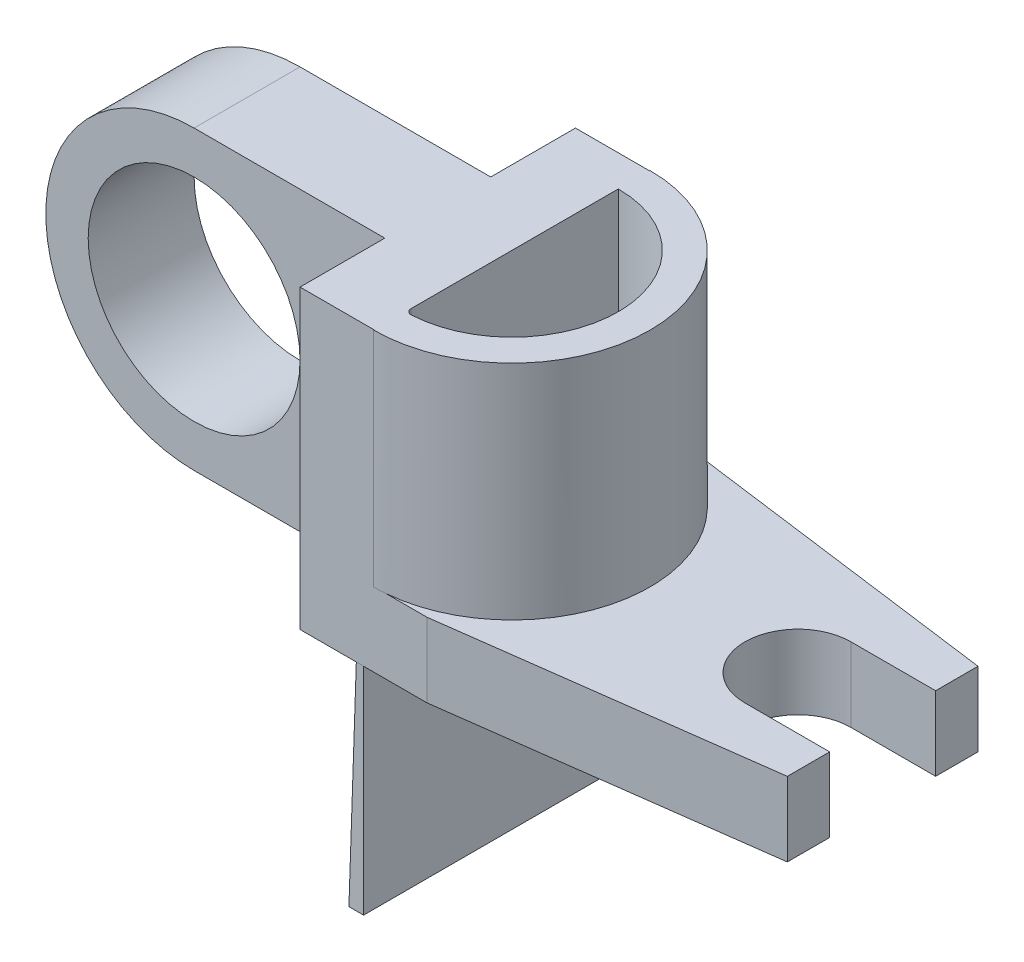
ISO-10303-21;
HEADER;
FILE_DESCRIPTION(('STEP AP214'),'2;1');
FILE_NAME('part.step','',(''),(''),'','','');
FILE_SCHEMA(('AUTOMOTIVE_DESIGN { 1 0 10303 214 1 1 1 1 }'));
ENDSEC;
DATA;
#1=APPLICATION_CONTEXT('core data for automotive mechanical design processes');
#2=APPLICATION_PROTOCOL_DEFINITION('international standard','automotive_design',2000,#1);
#3=PRODUCT_CONTEXT('',#1,'mechanical');
#4=PRODUCT('Part','Part','',(#3));
#5=PRODUCT_RELATED_PRODUCT_CATEGORY('part','',(#4));
#6=PRODUCT_DEFINITION_FORMATION('','',#4);
#7=PRODUCT_DEFINITION_CONTEXT('part definition',#1,'design');
#8=PRODUCT_DEFINITION('design','',#6,#7);
#9=PRODUCT_DEFINITION_SHAPE('','',#8);
#10=(LENGTH_UNIT() NAMED_UNIT(*) SI_UNIT(.MILLI.,.METRE.));
#11=(NAMED_UNIT(*) PLANE_ANGLE_UNIT() SI_UNIT($,.RADIAN.));
#12=(NAMED_UNIT(*) SI_UNIT($,.STERADIAN.) SOLID_ANGLE_UNIT());
#13=UNCERTAINTY_MEASURE_WITH_UNIT(LENGTH_MEASURE(1.E-05),#10,'distance_accuracy_value','');
#14=(GEOMETRIC_REPRESENTATION_CONTEXT(3) GLOBAL_UNCERTAINTY_ASSIGNED_CONTEXT((#13)) GLOBAL_UNIT_ASSIGNED_CONTEXT((#10,
#11,#12)) REPRESENTATION_CONTEXT('',''));
#15=CARTESIAN_POINT('',(0.,0.,0.));
#16=DIRECTION('',(0.,0.,1.));
#17=DIRECTION('',(1.,0.,0.));
#18=AXIS2_PLACEMENT_3D('',#15,#16,#17);
#19=CARTESIAN_POINT('',(-10.5939393939394,-7.55151515151515,10.));
#20=DIRECTION('',(0.,1.,0.));
#21=DIRECTION('',(-1.,0.,0.));
#22=AXIS2_PLACEMENT_3D('',#19,#20,#21);
#23=PLANE('',#22);
#24=DIRECTION('',(0.,0.,1.));
#25=VECTOR('',#24,1.);
#26=CARTESIAN_POINT('',(-4.59393939393939,-7.55151515151515,18.));
#27=LINE('',#26,#25);
#28=CARTESIAN_POINT('',(-4.59393939393939,-7.55151515151515,-8.));
#29=VERTEX_POINT('',#28);
#30=CARTESIAN_POINT('',(-4.59393939393939,-7.55151515151515,18.));
#31=VERTEX_POINT('',#30);
#32=EDGE_CURVE('E224',#29,#31,#27,.T.);
#33=ORIENTED_EDGE('',*,*,#32,.F.);
#34=DIRECTION('',(-1.,0.,0.));
#35=VECTOR('',#34,1.);
#36=CARTESIAN_POINT('',(-3.59393939393939,-7.55151515151516,-8.));
#37=LINE('',#36,#35);
#38=CARTESIAN_POINT('',(1.40606060606061,-7.55151515151515,-8.));
#39=VERTEX_POINT('',#38);
#40=EDGE_CURVE('E232',#39,#29,#37,.T.);
#41=ORIENTED_EDGE('',*,*,#40,.F.);
#42=DIRECTION('',(0.991227900682635,0.,0.132163720091018));
#43=VECTOR('',#42,1.);
#44=CARTESIAN_POINT('',(1.40606060606061,-7.55151515151515,-8.));
#45=LINE('',#44,#43);
#46=CARTESIAN_POINT('',(31.4060606060606,-7.55151515151515,-4.));
#47=VERTEX_POINT('',#46);
#48=EDGE_CURVE('E428',#39,#47,#45,.T.);
#49=ORIENTED_EDGE('',*,*,#48,.T.);
#50=DIRECTION('',(0.,0.,-1.));
#51=VECTOR('',#50,1.);
#52=CARTESIAN_POINT('',(31.4060606060606,-7.55151515151515,0.));
#53=LINE('',#52,#51);
#54=CARTESIAN_POINT('',(31.4060606060606,-7.55151515151515,0.));
#55=VERTEX_POINT('',#54);
#56=EDGE_CURVE('E425',#55,#47,#53,.T.);
#57=ORIENTED_EDGE('',*,*,#56,.F.);
#58=DIRECTION('',(1.,0.,0.));
#59=VECTOR('',#58,1.);
#60=CARTESIAN_POINT('',(23.4060606060606,-7.55151515151515,0.));
#61=LINE('',#60,#59);
#62=CARTESIAN_POINT('',(23.4060606060606,-7.55151515151515,0.));
#63=VERTEX_POINT('',#62);
#64=EDGE_CURVE('E422',#63,#55,#61,.T.);
#65=ORIENTED_EDGE('',*,*,#64,.F.);
#66=CARTESIAN_POINT('',(23.4060606060606,-7.55151515151515,5.));
#67=DIRECTION('',(0.,1.,0.));
#68=DIRECTION('',(-1.,0.,0.));
#69=AXIS2_PLACEMENT_3D('',#66,#67,#68);
#70=CIRCLE('',#69,5.);
#71=CARTESIAN_POINT('',(23.4060606060606,-7.55151515151515,10.));
#72=VERTEX_POINT('',#71);
#73=EDGE_CURVE('E420',#63,#72,#70,.T.);
#74=ORIENTED_EDGE('',*,*,#73,.T.);
#75=DIRECTION('',(1.,0.,0.));
#76=VECTOR('',#75,1.);
#77=CARTESIAN_POINT('',(23.4060606060606,-7.55151515151515,10.));
#78=LINE('',#77,#76);
#79=CARTESIAN_POINT('',(31.4060606060606,-7.55151515151515,10.));
#80=VERTEX_POINT('',#79);
#81=EDGE_CURVE('E418',#72,#80,#78,.T.);
#82=ORIENTED_EDGE('',*,*,#81,.T.);
#83=DIRECTION('',(0.,0.,-1.));
#84=VECTOR('',#83,1.);
#85=CARTESIAN_POINT('',(31.4060606060606,-7.55151515151515,14.));
#86=LINE('',#85,#84);
#87=CARTESIAN_POINT('',(31.4060606060606,-7.55151515151515,14.));
#88=VERTEX_POINT('',#87);
#89=EDGE_CURVE('E414',#88,#80,#86,.T.);
#90=ORIENTED_EDGE('',*,*,#89,.F.);
#91=DIRECTION('',(0.991227900682635,0.,-0.132163720091018));
#92=VECTOR('',#91,1.);
#93=CARTESIAN_POINT('',(1.40606060606061,-7.55151515151515,18.));
#94=LINE('',#93,#92);
#95=CARTESIAN_POINT('',(1.40606060606061,-7.55151515151515,18.));
#96=VERTEX_POINT('',#95);
#97=EDGE_CURVE('E411',#96,#88,#94,.T.);
#98=ORIENTED_EDGE('',*,*,#97,.F.);
#99=DIRECTION('',(-1.,0.,0.));
#100=VECTOR('',#99,1.);
#101=CARTESIAN_POINT('',(-3.59393939393939,-7.55151515151516,18.));
#102=LINE('',#101,#100);
#103=EDGE_CURVE('E235',#96,#31,#102,.T.);
#104=ORIENTED_EDGE('',*,*,#103,.T.);
#105=EDGE_LOOP('',(#33,#41,#49,#57,#65,#74,#82,#90,#98,#104));
#106=FACE_BOUND('',#105,.T.);
#107=ADVANCED_FACE('F37',(#106),#23,.F.);
#108=DIRECTION('',(0.,0.,-1.));
#109=VECTOR('',#108,1.);
#110=CARTESIAN_POINT('',(-5.281934947352,-7.55151515151515,18.));
#111=LINE('',#110,#109);
#112=CARTESIAN_POINT('',(-5.281934947352,-7.55151515151515,18.));
#113=VERTEX_POINT('',#112);
#114=CARTESIAN_POINT('',(-5.281934947352,-7.55151515151516,-8.));
#115=VERTEX_POINT('',#114);
#116=EDGE_CURVE('E217',#113,#115,#111,.T.);
#117=ORIENTED_EDGE('',*,*,#116,.F.);
#118=CARTESIAN_POINT('',(-10.5939393939394,-7.55151515151516,18.));
#119=VERTEX_POINT('',#118);
#120=EDGE_CURVE('E243',#113,#119,#102,.T.);
#121=ORIENTED_EDGE('',*,*,#120,.T.);
#122=DIRECTION('',(0.,0.,1.));
#123=VECTOR('',#122,1.);
#124=CARTESIAN_POINT('',(-10.5939393939394,-7.55151515151516,10.));
#125=LINE('',#124,#123);
#126=CARTESIAN_POINT('',(-10.5939393939394,-7.55151515151516,10.));
#127=VERTEX_POINT('',#126);
#128=EDGE_CURVE('E331',#127,#119,#125,.T.);
#129=ORIENTED_EDGE('',*,*,#128,.F.);
#130=DIRECTION('',(1.,0.,0.));
#131=VECTOR('',#130,1.);
#132=CARTESIAN_POINT('',(-10.5939393939394,-7.55151515151515,10.));
#133=LINE('',#132,#131);
#134=CARTESIAN_POINT('',(-28.5939393939394,-7.55151515151516,10.));
#135=VERTEX_POINT('',#134);
#136=EDGE_CURVE('E267',#135,#127,#133,.T.);
#137=ORIENTED_EDGE('',*,*,#136,.F.);
#138=DIRECTION('',(0.,0.,-1.));
#139=VECTOR('',#138,1.);
#140=CARTESIAN_POINT('',(-28.5939393939394,-7.55151515151516,10.));
#141=LINE('',#140,#139);
#142=CARTESIAN_POINT('',(-28.5939393939394,-7.55151515151516,0.));
#143=VERTEX_POINT('',#142);
#144=EDGE_CURVE('E273',#135,#143,#141,.T.);
#145=ORIENTED_EDGE('',*,*,#144,.T.);
#146=DIRECTION('',(1.,0.,0.));
#147=VECTOR('',#146,1.);
#148=CARTESIAN_POINT('',(-10.5939393939394,-7.55151515151515,0.));
#149=LINE('',#148,#147);
#150=CARTESIAN_POINT('',(-10.5939393939394,-7.55151515151516,0.));
#151=VERTEX_POINT('',#150);
#152=EDGE_CURVE('E278',#143,#151,#149,.T.);
#153=ORIENTED_EDGE('',*,*,#152,.T.);
#154=CARTESIAN_POINT('',(-10.5939393939394,-7.55151515151516,-8.));
#155=VERTEX_POINT('',#154);
#156=EDGE_CURVE('E333',#155,#151,#125,.T.);
#157=ORIENTED_EDGE('',*,*,#156,.F.);
#158=EDGE_CURVE('E244',#115,#155,#37,.T.);
#159=ORIENTED_EDGE('',*,*,#158,.F.);
#160=EDGE_LOOP('',(#117,#121,#129,#137,#145,#153,#157,#159));
#161=FACE_BOUND('',#160,.T.);
#162=ADVANCED_FACE('F353',(#161),#23,.F.);
#163=CARTESIAN_POINT('',(-3.59393939393939,0.,0.));
#164=DIRECTION('',(1.,0.,0.));
#165=DIRECTION('',(0.,1.,0.));
#166=AXIS2_PLACEMENT_3D('',#163,#164,#165);
#167=PLANE('',#166);
#168=DIRECTION('',(0.,0.,-1.));
#169=VECTOR('',#168,1.);
#170=CARTESIAN_POINT('',(-3.5939393939394,20.4484848484849,10.));
#171=LINE('',#170,#169);
#172=CARTESIAN_POINT('',(-3.5939393939394,20.4484848484849,14.5308384424122));
#173=VERTEX_POINT('',#172);
#174=CARTESIAN_POINT('',(-3.5939393939394,20.4484848484849,-5.04394475127356));
#175=VERTEX_POINT('',#174);
#176=EDGE_CURVE('E312',#173,#175,#171,.T.);
#177=ORIENTED_EDGE('',*,*,#176,.F.);
#178=DIRECTION('',(0.,-1.,0.));
#179=VECTOR('',#178,1.);
#180=CARTESIAN_POINT('',(-3.59393939393939,0.,14.5308384424122));
#181=LINE('',#180,#179);
#182=CARTESIAN_POINT('',(-3.59393939393939,-0.551515151515155,14.5308384424122));
#183=VERTEX_POINT('',#182);
#184=EDGE_CURVE('E290',#173,#183,#181,.T.);
#185=ORIENTED_EDGE('',*,*,#184,.T.);
#186=DIRECTION('',(0.,0.,-1.));
#187=VECTOR('',#186,1.);
#188=CARTESIAN_POINT('',(-3.59393939393939,-0.551515151515155,18.));
#189=LINE('',#188,#187);
#190=CARTESIAN_POINT('',(-3.59393939393939,-0.551515151515157,-5.04394475127356));
#191=VERTEX_POINT('',#190);
#192=EDGE_CURVE('E298',#183,#191,#189,.T.);
#193=ORIENTED_EDGE('',*,*,#192,.T.);
#194=DIRECTION('',(0.,-1.,0.));
#195=VECTOR('',#194,1.);
#196=CARTESIAN_POINT('',(-3.5939393939394,49.6156320070841,-5.04394475127356));
#197=LINE('',#196,#195);
#198=EDGE_CURVE('E304',#175,#191,#197,.T.);
#199=ORIENTED_EDGE('',*,*,#198,.F.);
#200=EDGE_LOOP('',(#177,#185,#193,#199));
#201=FACE_BOUND('',#200,.T.);
#202=ADVANCED_FACE('F315',(#201),#167,.T.);
#203=CARTESIAN_POINT('',(1.40606060606061,-0.551515151515154,18.));
#204=DIRECTION('',(0.,1.,0.));
#205=DIRECTION('',(-1.,0.,0.));
#206=AXIS2_PLACEMENT_3D('',#203,#204,#205);
#207=PLANE('',#206);
#208=DIRECTION('',(-1.,0.,0.));
#209=VECTOR('',#208,1.);
#210=CARTESIAN_POINT('',(1.40606060606061,-0.551515151515154,-8.));
#211=LINE('',#210,#209);
#212=CARTESIAN_POINT('',(1.40606060606061,-0.551515151515154,-8.));
#213=VERTEX_POINT('',#212);
#214=CARTESIAN_POINT('',(-2.52412881524946,-0.551515151515155,-8.));
#215=VERTEX_POINT('',#214);
#216=EDGE_CURVE('E324',#213,#215,#211,.T.);
#217=ORIENTED_EDGE('',*,*,#216,.T.);
#218=CARTESIAN_POINT('',(-3.59393939393939,-0.551515151515157,5.));
#219=DIRECTION('',(0.,1.,0.));
#220=DIRECTION('',(-1.,0.,0.));
#221=AXIS2_PLACEMENT_3D('',#218,#219,#220);
#222=CIRCLE('',#221,13.0439447512736);
#223=CARTESIAN_POINT('',(-2.52412881524946,-0.551515151515155,18.));
#224=VERTEX_POINT('',#223);
#225=EDGE_CURVE('E287',#215,#224,#222,.F.);
#226=ORIENTED_EDGE('',*,*,#225,.T.);
#227=DIRECTION('',(-1.,0.,0.));
#228=VECTOR('',#227,1.);
#229=CARTESIAN_POINT('',(1.40606060606061,-0.551515151515154,18.));
#230=LINE('',#229,#228);
#231=CARTESIAN_POINT('',(1.40606060606061,-0.551515151515154,18.));
#232=VERTEX_POINT('',#231);
#233=EDGE_CURVE('E332',#232,#224,#230,.T.);
#234=ORIENTED_EDGE('',*,*,#233,.F.);
#235=DIRECTION('',(0.991227900682635,0.,-0.132163720091018));
#236=VECTOR('',#235,1.);
#237=CARTESIAN_POINT('',(1.40606060606061,-0.551515151515154,18.));
#238=LINE('',#237,#236);
#239=CARTESIAN_POINT('',(31.4060606060606,-0.551515151515151,14.));
#240=VERTEX_POINT('',#239);
#241=EDGE_CURVE('E393',#232,#240,#238,.T.);
#242=ORIENTED_EDGE('',*,*,#241,.T.);
#243=DIRECTION('',(0.,0.,-1.));
#244=VECTOR('',#243,1.);
#245=CARTESIAN_POINT('',(31.4060606060606,-0.551515151515151,14.));
#246=LINE('',#245,#244);
#247=CARTESIAN_POINT('',(31.4060606060606,-0.551515151515151,10.));
#248=VERTEX_POINT('',#247);
#249=EDGE_CURVE('E433',#240,#248,#246,.T.);
#250=ORIENTED_EDGE('',*,*,#249,.T.);
#251=DIRECTION('',(1.,0.,0.));
#252=VECTOR('',#251,1.);
#253=CARTESIAN_POINT('',(23.4060606060606,-0.551515151515152,10.));
#254=LINE('',#253,#252);
#255=CARTESIAN_POINT('',(23.4060606060606,-0.551515151515152,10.));
#256=VERTEX_POINT('',#255);
#257=EDGE_CURVE('E436',#256,#248,#254,.T.);
#258=ORIENTED_EDGE('',*,*,#257,.F.);
#259=CARTESIAN_POINT('',(23.4060606060606,-0.551515151515152,5.));
#260=DIRECTION('',(0.,1.,0.));
#261=DIRECTION('',(-1.,0.,0.));
#262=AXIS2_PLACEMENT_3D('',#259,#260,#261);
#263=CIRCLE('',#262,5.);
#264=CARTESIAN_POINT('',(23.4060606060606,-0.551515151515152,0.));
#265=VERTEX_POINT('',#264);
#266=EDGE_CURVE('E439',#265,#256,#263,.T.);
#267=ORIENTED_EDGE('',*,*,#266,.F.);
#268=DIRECTION('',(1.,0.,0.));
#269=VECTOR('',#268,1.);
#270=CARTESIAN_POINT('',(23.4060606060606,-0.551515151515152,0.));
#271=LINE('',#270,#269);
#272=CARTESIAN_POINT('',(31.4060606060606,-0.551515151515151,0.));
#273=VERTEX_POINT('',#272);
#274=EDGE_CURVE('E441',#265,#273,#271,.T.);
#275=ORIENTED_EDGE('',*,*,#274,.T.);
#276=DIRECTION('',(0.,0.,-1.));
#277=VECTOR('',#276,1.);
#278=CARTESIAN_POINT('',(31.4060606060606,-0.551515151515151,0.));
#279=LINE('',#278,#277);
#280=CARTESIAN_POINT('',(31.4060606060606,-0.551515151515151,-4.));
#281=VERTEX_POINT('',#280);
#282=EDGE_CURVE('E444',#273,#281,#279,.T.);
#283=ORIENTED_EDGE('',*,*,#282,.T.);
#284=DIRECTION('',(0.991227900682635,0.,0.132163720091018));
#285=VECTOR('',#284,1.);
#286=CARTESIAN_POINT('',(1.40606060606061,-0.551515151515154,-8.));
#287=LINE('',#286,#285);
#288=EDGE_CURVE('E415',#213,#281,#287,.T.);
#289=ORIENTED_EDGE('',*,*,#288,.F.);
#290=EDGE_LOOP('',(#217,#226,#234,#242,#250,#258,#267,#275,#283,#289));
#291=FACE_BOUND('',#290,.T.);
#292=ADVANCED_FACE('F481',(#291),#207,.T.);
#293=ORIENTED_EDGE('',*,*,#192,.F.);
#294=CARTESIAN_POINT('',(-3.09393939393939,-0.551515151515157,14.5308384424122));
#295=DIRECTION('',(0.,1.,0.));
#296=DIRECTION('',(-1.,0.,0.));
#297=AXIS2_PLACEMENT_3D('',#294,#295,#296);
#298=CIRCLE('',#297,0.5);
#299=CARTESIAN_POINT('',(-3.06774477457441,-0.551515151515155,15.0301518128684));
#300=VERTEX_POINT('',#299);
#301=EDGE_CURVE('E293',#183,#300,#298,.T.);
#302=ORIENTED_EDGE('',*,*,#301,.T.);
#303=CARTESIAN_POINT('',(-3.59393939393939,-0.551515151515155,5.));
#304=DIRECTION('',(0.,-1.,0.));
#305=DIRECTION('',(1.,0.,0.));
#306=AXIS2_PLACEMENT_3D('',#303,#304,#305);
#307=CIRCLE('',#306,10.0439447512736);
#308=EDGE_CURVE('E216',#191,#300,#307,.T.);
#309=ORIENTED_EDGE('',*,*,#308,.F.);
#310=EDGE_LOOP('',(#293,#302,#309));
#311=FACE_BOUND('',#310,.T.);
#312=ADVANCED_FACE('F297',(#311),#207,.T.);
#313=CARTESIAN_POINT('',(-28.5939393939394,6.44848484848484,10.));
#314=DIRECTION('',(0.,0.,1.));
#315=DIRECTION('',(1.,0.,0.));
#316=AXIS2_PLACEMENT_3D('',#313,#314,#315);
#317=PLANE('',#316);
#318=DIRECTION('',(-1.,0.,0.));
#319=VECTOR('',#318,1.);
#320=CARTESIAN_POINT('',(-10.5939393939394,20.4484848484849,10.));
#321=LINE('',#320,#319);
#322=CARTESIAN_POINT('',(-10.5939393939394,20.4484848484849,10.));
#323=VERTEX_POINT('',#322);
#324=CARTESIAN_POINT('',(-28.5939393939394,20.4484848484848,10.));
#325=VERTEX_POINT('',#324);
#326=EDGE_CURVE('E261',#323,#325,#321,.T.);
#327=ORIENTED_EDGE('',*,*,#326,.T.);
#328=CARTESIAN_POINT('',(-28.5939393939394,6.44848484848484,10.));
#329=DIRECTION('',(0.,0.,1.));
#330=DIRECTION('',(1.,0.,0.));
#331=AXIS2_PLACEMENT_3D('',#328,#329,#330);
#332=CIRCLE('',#331,14.);
#333=EDGE_CURVE('E264',#325,#135,#332,.T.);
#334=ORIENTED_EDGE('',*,*,#333,.T.);
#335=ORIENTED_EDGE('',*,*,#136,.T.);
#336=DIRECTION('',(0.,1.,0.));
#337=VECTOR('',#336,1.);
#338=CARTESIAN_POINT('',(-10.5939393939394,20.4484848484849,10.));
#339=LINE('',#338,#337);
#340=EDGE_CURVE('E270',#127,#323,#339,.T.);
#341=ORIENTED_EDGE('',*,*,#340,.T.);
#342=EDGE_LOOP('',(#327,#334,#335,#341));
#343=FACE_BOUND('',#342,.T.);
#344=CARTESIAN_POINT('',(-28.5939393939394,6.44848484848484,10.));
#345=DIRECTION('',(0.,0.,1.));
#346=DIRECTION('',(1.,0.,0.));
#347=AXIS2_PLACEMENT_3D('',#344,#345,#346);
#348=CIRCLE('',#347,10.);
#349=CARTESIAN_POINT('',(-18.5939393939394,6.44848484848484,10.));
#350=VERTEX_POINT('',#349);
#351=EDGE_CURVE('E253',#350,#350,#348,.T.);
#352=ORIENTED_EDGE('',*,*,#351,.F.);
#353=EDGE_LOOP('',(#352));
#354=FACE_BOUND('',#353,.T.);
#355=ADVANCED_FACE('F355',(#343,#354),#317,.T.);
#356=CARTESIAN_POINT('',(-28.5939393939394,6.44848484848484,0.));
#357=DIRECTION('',(0.,0.,1.));
#358=DIRECTION('',(1.,0.,0.));
#359=AXIS2_PLACEMENT_3D('',#356,#357,#358);
#360=PLANE('',#359);
#361=DIRECTION('',(-1.,0.,0.));
#362=VECTOR('',#361,1.);
#363=CARTESIAN_POINT('',(-10.5939393939394,20.4484848484849,0.));
#364=LINE('',#363,#362);
#365=CARTESIAN_POINT('',(-10.5939393939394,20.4484848484849,0.));
#366=VERTEX_POINT('',#365);
#367=CARTESIAN_POINT('',(-28.5939393939394,20.4484848484848,0.));
#368=VERTEX_POINT('',#367);
#369=EDGE_CURVE('E256',#366,#368,#364,.T.);
#370=ORIENTED_EDGE('',*,*,#369,.F.);
#371=DIRECTION('',(0.,1.,0.));
#372=VECTOR('',#371,1.);
#373=CARTESIAN_POINT('',(-10.5939393939394,20.4484848484849,0.));
#374=LINE('',#373,#372);
#375=EDGE_CURVE('E265',#151,#366,#374,.T.);
#376=ORIENTED_EDGE('',*,*,#375,.F.);
#377=ORIENTED_EDGE('',*,*,#152,.F.);
#378=CARTESIAN_POINT('',(-28.5939393939394,6.44848484848484,0.));
#379=DIRECTION('',(0.,0.,1.));
#380=DIRECTION('',(1.,0.,0.));
#381=AXIS2_PLACEMENT_3D('',#378,#379,#380);
#382=CIRCLE('',#381,14.);
#383=EDGE_CURVE('E276',#368,#143,#382,.T.);
#384=ORIENTED_EDGE('',*,*,#383,.F.);
#385=EDGE_LOOP('',(#370,#376,#377,#384));
#386=FACE_BOUND('',#385,.T.);
#387=CARTESIAN_POINT('',(-28.5939393939394,6.44848484848484,0.));
#388=DIRECTION('',(0.,0.,1.));
#389=DIRECTION('',(1.,0.,0.));
#390=AXIS2_PLACEMENT_3D('',#387,#388,#389);
#391=CIRCLE('',#390,10.);
#392=CARTESIAN_POINT('',(-18.5939393939394,6.44848484848484,0.));
#393=VERTEX_POINT('',#392);
#394=EDGE_CURVE('E257',#393,#393,#391,.T.);
#395=ORIENTED_EDGE('',*,*,#394,.T.);
#396=EDGE_LOOP('',(#395));
#397=FACE_BOUND('',#396,.T.);
#398=ADVANCED_FACE('F367',(#386,#397),#360,.F.);
#399=CARTESIAN_POINT('',(-10.5939393939394,20.4484848484849,10.));
#400=DIRECTION('',(0.,-1.,0.));
#401=DIRECTION('',(1.,0.,0.));
#402=AXIS2_PLACEMENT_3D('',#399,#400,#401);
#403=PLANE('',#402);
#404=DIRECTION('',(0.,0.,-1.));
#405=VECTOR('',#404,1.);
#406=CARTESIAN_POINT('',(-3.59393939393939,20.4484848484849,-8.04394475127356));
#407=LINE('',#406,#405);
#408=CARTESIAN_POINT('',(-3.59393939393939,20.4484848484849,-8.));
#409=VERTEX_POINT('',#408);
#410=CARTESIAN_POINT('',(-3.59393939393939,20.4484848484849,-8.04394475127356));
#411=VERTEX_POINT('',#410);
#412=EDGE_CURVE('E375',#409,#411,#407,.T.);
#413=ORIENTED_EDGE('',*,*,#412,.F.);
#414=DIRECTION('',(-1.,0.,0.));
#415=VECTOR('',#414,1.);
#416=CARTESIAN_POINT('',(-3.5939393939394,20.4484848484849,-8.));
#417=LINE('',#416,#415);
#418=CARTESIAN_POINT('',(-10.5939393939394,20.4484848484849,-8.));
#419=VERTEX_POINT('',#418);
#420=EDGE_CURVE('E247',#409,#419,#417,.T.);
#421=ORIENTED_EDGE('',*,*,#420,.T.);
#422=DIRECTION('',(0.,0.,1.));
#423=VECTOR('',#422,1.);
#424=CARTESIAN_POINT('',(-10.5939393939394,20.4484848484849,10.));
#425=LINE('',#424,#423);
#426=EDGE_CURVE('E317',#419,#366,#425,.T.);
#427=ORIENTED_EDGE('',*,*,#426,.T.);
#428=ORIENTED_EDGE('',*,*,#369,.T.);
#429=DIRECTION('',(0.,0.,-1.));
#430=VECTOR('',#429,1.);
#431=CARTESIAN_POINT('',(-28.5939393939394,20.4484848484848,10.));
#432=LINE('',#431,#430);
#433=EDGE_CURVE('E284',#325,#368,#432,.T.);
#434=ORIENTED_EDGE('',*,*,#433,.F.);
#435=ORIENTED_EDGE('',*,*,#326,.F.);
#436=CARTESIAN_POINT('',(-10.5939393939394,20.4484848484849,18.));
#437=VERTEX_POINT('',#436);
#438=EDGE_CURVE('E321',#323,#437,#425,.T.);
#439=ORIENTED_EDGE('',*,*,#438,.T.);
#440=DIRECTION('',(-1.,0.,0.));
#441=VECTOR('',#440,1.);
#442=CARTESIAN_POINT('',(-3.5939393939394,20.4484848484849,18.));
#443=LINE('',#442,#441);
#444=CARTESIAN_POINT('',(-3.5939393939394,20.4484848484849,18.));
#445=VERTEX_POINT('',#444);
#446=EDGE_CURVE('E260',#445,#437,#443,.T.);
#447=ORIENTED_EDGE('',*,*,#446,.F.);
#448=DIRECTION('',(0.,0.,-1.));
#449=VECTOR('',#448,1.);
#450=CARTESIAN_POINT('',(-3.59393939393939,20.4484848484849,15.0439447512736));
#451=LINE('',#450,#449);
#452=CARTESIAN_POINT('',(-3.5939393939394,20.4484848484849,18.0439447512736));
#453=VERTEX_POINT('',#452);
#454=EDGE_CURVE('E391',#453,#445,#451,.T.);
#455=ORIENTED_EDGE('',*,*,#454,.F.);
#456=CARTESIAN_POINT('',(-3.5939393939394,20.4484848484849,5.));
#457=DIRECTION('',(0.,-1.,0.));
#458=DIRECTION('',(1.,0.,0.));
#459=AXIS2_PLACEMENT_3D('',#456,#457,#458);
#460=CIRCLE('',#459,13.0439447512736);
#461=EDGE_CURVE('E388',#411,#453,#460,.T.);
#462=ORIENTED_EDGE('',*,*,#461,.F.);
#463=EDGE_LOOP('',(#413,#421,#427,#428,#434,#435,#439,#447,#455,#462));
#464=FACE_BOUND('',#463,.T.);
#465=CARTESIAN_POINT('',(-3.5939393939394,20.4484848484849,5.));
#466=DIRECTION('',(0.,-1.,0.));
#467=DIRECTION('',(1.,0.,0.));
#468=AXIS2_PLACEMENT_3D('',#465,#466,#467);
#469=CIRCLE('',#468,10.0439447512736);
#470=CARTESIAN_POINT('',(-3.06774477457442,20.4484848484849,15.0301518128684));
#471=VERTEX_POINT('',#470);
#472=EDGE_CURVE('E313',#471,#175,#469,.F.);
#473=ORIENTED_EDGE('',*,*,#472,.F.);
#474=CARTESIAN_POINT('',(-3.0939393939394,20.4484848484849,14.5308384424122));
#475=DIRECTION('',(0.,-1.,0.));
#476=DIRECTION('',(1.,0.,0.));
#477=AXIS2_PLACEMENT_3D('',#474,#475,#476);
#478=CIRCLE('',#477,0.5);
#479=EDGE_CURVE('E11',#471,#173,#478,.T.);
#480=ORIENTED_EDGE('',*,*,#479,.T.);
#481=ORIENTED_EDGE('',*,*,#176,.T.);
#482=EDGE_LOOP('',(#473,#480,#481));
#483=FACE_BOUND('',#482,.T.);
#484=ADVANCED_FACE('F311',(#464,#483),#403,.F.);
#485=CARTESIAN_POINT('',(-28.5939393939394,6.44848484848484,10.));
#486=DIRECTION('',(0.,0.,-1.));
#487=DIRECTION('',(-1.,0.,0.));
#488=AXIS2_PLACEMENT_3D('',#485,#486,#487);
#489=CYLINDRICAL_SURFACE('',#488,14.);
#490=ORIENTED_EDGE('',*,*,#383,.T.);
#491=ORIENTED_EDGE('',*,*,#144,.F.);
#492=ORIENTED_EDGE('',*,*,#333,.F.);
#493=ORIENTED_EDGE('',*,*,#433,.T.);
#494=EDGE_LOOP('',(#490,#491,#492,#493));
#495=FACE_BOUND('',#494,.T.);
#496=ADVANCED_FACE('F361',(#495),#489,.T.);
#497=CARTESIAN_POINT('',(-28.5939393939394,6.44848484848484,10.));
#498=DIRECTION('',(0.,0.,-1.));
#499=DIRECTION('',(-1.,0.,0.));
#500=AXIS2_PLACEMENT_3D('',#497,#498,#499);
#501=CYLINDRICAL_SURFACE('',#500,10.);
#502=ORIENTED_EDGE('',*,*,#351,.T.);
#503=EDGE_LOOP('',(#502));
#504=FACE_BOUND('',#503,.T.);
#505=ORIENTED_EDGE('',*,*,#394,.F.);
#506=EDGE_LOOP('',(#505));
#507=FACE_BOUND('',#506,.T.);
#508=ADVANCED_FACE('F528',(#504,#507),#501,.F.);
#509=CARTESIAN_POINT('',(-10.5939393939394,0.,0.));
#510=DIRECTION('',(1.,0.,0.));
#511=DIRECTION('',(0.,1.,0.));
#512=AXIS2_PLACEMENT_3D('',#509,#510,#511);
#513=PLANE('',#512);
#514=ORIENTED_EDGE('',*,*,#156,.T.);
#515=ORIENTED_EDGE('',*,*,#375,.T.);
#516=ORIENTED_EDGE('',*,*,#426,.F.);
#517=DIRECTION('',(0.,1.,0.));
#518=VECTOR('',#517,1.);
#519=CARTESIAN_POINT('',(-10.5939393939394,-7.55151515151516,-8.));
#520=LINE('',#519,#518);
#521=EDGE_CURVE('E328',#155,#419,#520,.T.);
#522=ORIENTED_EDGE('',*,*,#521,.F.);
#523=EDGE_LOOP('',(#514,#515,#516,#522));
#524=FACE_BOUND('',#523,.T.);
#525=ADVANCED_FACE('F370',(#524),#513,.F.);
#526=CARTESIAN_POINT('',(-3.5939393939394,20.4484848484849,18.));
#527=DIRECTION('',(0.,0.,-1.));
#528=DIRECTION('',(-1.,0.,0.));
#529=AXIS2_PLACEMENT_3D('',#526,#527,#528);
#530=PLANE('',#529);
#531=DIRECTION('',(-1.,0.,0.));
#532=VECTOR('',#531,1.);
#533=CARTESIAN_POINT('',(-4.59393939393939,-7.55151515151515,18.));
#534=LINE('',#533,#532);
#535=EDGE_CURVE('E236',#31,#113,#534,.T.);
#536=ORIENTED_EDGE('',*,*,#535,.F.);
#537=ORIENTED_EDGE('',*,*,#103,.F.);
#538=DIRECTION('',(0.,1.,0.));
#539=VECTOR('',#538,1.);
#540=CARTESIAN_POINT('',(1.40606060606061,-7.55151515151515,18.));
#541=LINE('',#540,#539);
#542=EDGE_CURVE('E462',#96,#232,#541,.T.);
#543=ORIENTED_EDGE('',*,*,#542,.T.);
#544=ORIENTED_EDGE('',*,*,#233,.T.);
#545=CARTESIAN_POINT('',(-3.5939393939394,-0.551515151515155,18.));
#546=VERTEX_POINT('',#545);
#547=EDGE_CURVE('E466',#224,#546,#230,.T.);
#548=ORIENTED_EDGE('',*,*,#547,.T.);
#549=DIRECTION('',(0.,-1.,0.));
#550=VECTOR('',#549,1.);
#551=CARTESIAN_POINT('',(-3.5939393939394,20.4484848484849,18.));
#552=LINE('',#551,#550);
#553=EDGE_CURVE('E252',#445,#546,#552,.T.);
#554=ORIENTED_EDGE('',*,*,#553,.F.);
#555=ORIENTED_EDGE('',*,*,#446,.T.);
#556=DIRECTION('',(0.,-1.,0.));
#557=VECTOR('',#556,1.);
#558=CARTESIAN_POINT('',(-10.5939393939394,20.4484848484849,18.));
#559=LINE('',#558,#557);
#560=EDGE_CURVE('E335',#437,#119,#559,.T.);
#561=ORIENTED_EDGE('',*,*,#560,.T.);
#562=ORIENTED_EDGE('',*,*,#120,.F.);
#563=EDGE_LOOP('',(#536,#537,#543,#544,#548,#554,#555,#561,#562));
#564=FACE_BOUND('',#563,.T.);
#565=ADVANCED_FACE('F342',(#564),#530,.F.);
#566=CARTESIAN_POINT('',(-3.59393939393939,-7.55151515151516,-8.));
#567=DIRECTION('',(0.,0.,1.));
#568=DIRECTION('',(1.,0.,0.));
#569=AXIS2_PLACEMENT_3D('',#566,#567,#568);
#570=PLANE('',#569);
#571=DIRECTION('',(1.,0.,0.));
#572=VECTOR('',#571,1.);
#573=CARTESIAN_POINT('',(-4.59393939393939,-7.55151515151515,-8.));
#574=LINE('',#573,#572);
#575=EDGE_CURVE('E209',#115,#29,#574,.T.);
#576=ORIENTED_EDGE('',*,*,#575,.F.);
#577=ORIENTED_EDGE('',*,*,#158,.T.);
#578=ORIENTED_EDGE('',*,*,#521,.T.);
#579=ORIENTED_EDGE('',*,*,#420,.F.);
#580=DIRECTION('',(0.,1.,0.));
#581=VECTOR('',#580,1.);
#582=CARTESIAN_POINT('',(-3.59393939393939,-7.55151515151516,-8.));
#583=LINE('',#582,#581);
#584=CARTESIAN_POINT('',(-3.59393939393939,-0.551515151515155,-8.));
#585=VERTEX_POINT('',#584);
#586=EDGE_CURVE('E316',#585,#409,#583,.T.);
#587=ORIENTED_EDGE('',*,*,#586,.F.);
#588=EDGE_CURVE('E464',#215,#585,#211,.T.);
#589=ORIENTED_EDGE('',*,*,#588,.F.);
#590=ORIENTED_EDGE('',*,*,#216,.F.);
#591=DIRECTION('',(0.,1.,0.));
#592=VECTOR('',#591,1.);
#593=CARTESIAN_POINT('',(1.40606060606061,-7.55151515151515,-8.));
#594=LINE('',#593,#592);
#595=EDGE_CURVE('E241',#39,#213,#594,.T.);
#596=ORIENTED_EDGE('',*,*,#595,.F.);
#597=ORIENTED_EDGE('',*,*,#40,.T.);
#598=EDGE_LOOP('',(#576,#577,#578,#579,#587,#589,#590,#596,#597));
#599=FACE_BOUND('',#598,.T.);
#600=ADVANCED_FACE('F239',(#599),#570,.F.);
#601=ORIENTED_EDGE('',*,*,#340,.F.);
#602=ORIENTED_EDGE('',*,*,#128,.T.);
#603=ORIENTED_EDGE('',*,*,#560,.F.);
#604=ORIENTED_EDGE('',*,*,#438,.F.);
#605=EDGE_LOOP('',(#601,#602,#603,#604));
#606=FACE_BOUND('',#605,.T.);
#607=ADVANCED_FACE('F348',(#606),#513,.F.);
#608=CARTESIAN_POINT('',(1.40606060606061,-7.55151515151515,18.));
#609=DIRECTION('',(0.132163720091018,0.,0.991227900682635));
#610=DIRECTION('',(0.991227900682635,0.,-0.132163720091018));
#611=AXIS2_PLACEMENT_3D('',#608,#609,#610);
#612=PLANE('',#611);
#613=ORIENTED_EDGE('',*,*,#241,.F.);
#614=ORIENTED_EDGE('',*,*,#542,.F.);
#615=ORIENTED_EDGE('',*,*,#97,.T.);
#616=DIRECTION('',(0.,1.,0.));
#617=VECTOR('',#616,1.);
#618=CARTESIAN_POINT('',(31.4060606060606,-7.55151515151515,14.));
#619=LINE('',#618,#617);
#620=EDGE_CURVE('E430',#88,#240,#619,.T.);
#621=ORIENTED_EDGE('',*,*,#620,.T.);
#622=EDGE_LOOP('',(#613,#614,#615,#621));
#623=FACE_BOUND('',#622,.T.);
#624=ADVANCED_FACE('F484',(#623),#612,.T.);
#625=CARTESIAN_POINT('',(1.40606060606061,-7.55151515151515,-8.));
#626=DIRECTION('',(-0.132163720091018,0.,0.991227900682635));
#627=DIRECTION('',(0.991227900682635,0.,0.132163720091018));
#628=AXIS2_PLACEMENT_3D('',#625,#626,#627);
#629=PLANE('',#628);
#630=ORIENTED_EDGE('',*,*,#288,.T.);
#631=DIRECTION('',(0.,1.,0.));
#632=VECTOR('',#631,1.);
#633=CARTESIAN_POINT('',(31.4060606060606,-7.55151515151515,-4.));
#634=LINE('',#633,#632);
#635=EDGE_CURVE('E449',#47,#281,#634,.T.);
#636=ORIENTED_EDGE('',*,*,#635,.F.);
#637=ORIENTED_EDGE('',*,*,#48,.F.);
#638=ORIENTED_EDGE('',*,*,#595,.T.);
#639=EDGE_LOOP('',(#630,#636,#637,#638));
#640=FACE_BOUND('',#639,.T.);
#641=ADVANCED_FACE('F509',(#640),#629,.F.);
#642=CARTESIAN_POINT('',(31.4060606060606,-7.55151515151515,0.));
#643=DIRECTION('',(1.,0.,0.));
#644=DIRECTION('',(0.,1.,0.));
#645=AXIS2_PLACEMENT_3D('',#642,#643,#644);
#646=PLANE('',#645);
#647=ORIENTED_EDGE('',*,*,#282,.F.);
#648=DIRECTION('',(0.,1.,0.));
#649=VECTOR('',#648,1.);
#650=CARTESIAN_POINT('',(31.4060606060606,-7.55151515151515,0.));
#651=LINE('',#650,#649);
#652=EDGE_CURVE('E451',#55,#273,#651,.T.);
#653=ORIENTED_EDGE('',*,*,#652,.F.);
#654=ORIENTED_EDGE('',*,*,#56,.T.);
#655=ORIENTED_EDGE('',*,*,#635,.T.);
#656=EDGE_LOOP('',(#647,#653,#654,#655));
#657=FACE_BOUND('',#656,.T.);
#658=ADVANCED_FACE('F505',(#657),#646,.T.);
#659=CARTESIAN_POINT('',(23.4060606060606,-7.55151515151515,0.));
#660=DIRECTION('',(0.,0.,1.));
#661=DIRECTION('',(1.,0.,0.));
#662=AXIS2_PLACEMENT_3D('',#659,#660,#661);
#663=PLANE('',#662);
#664=ORIENTED_EDGE('',*,*,#274,.F.);
#665=DIRECTION('',(0.,1.,0.));
#666=VECTOR('',#665,1.);
#667=CARTESIAN_POINT('',(23.4060606060606,-7.55151515151515,0.));
#668=LINE('',#667,#666);
#669=EDGE_CURVE('E453',#63,#265,#668,.T.);
#670=ORIENTED_EDGE('',*,*,#669,.F.);
#671=ORIENTED_EDGE('',*,*,#64,.T.);
#672=ORIENTED_EDGE('',*,*,#652,.T.);
#673=EDGE_LOOP('',(#664,#670,#671,#672));
#674=FACE_BOUND('',#673,.T.);
#675=ADVANCED_FACE('F502',(#674),#663,.T.);
#676=CARTESIAN_POINT('',(23.4060606060606,-7.55151515151515,5.));
#677=DIRECTION('',(0.,1.,0.));
#678=DIRECTION('',(-1.,0.,0.));
#679=AXIS2_PLACEMENT_3D('',#676,#677,#678);
#680=CYLINDRICAL_SURFACE('',#679,5.);
#681=ORIENTED_EDGE('',*,*,#266,.T.);
#682=DIRECTION('',(0.,1.,0.));
#683=VECTOR('',#682,1.);
#684=CARTESIAN_POINT('',(23.4060606060606,-7.55151515151515,10.));
#685=LINE('',#684,#683);
#686=EDGE_CURVE('E455',#72,#256,#685,.T.);
#687=ORIENTED_EDGE('',*,*,#686,.F.);
#688=ORIENTED_EDGE('',*,*,#73,.F.);
#689=ORIENTED_EDGE('',*,*,#669,.T.);
#690=EDGE_LOOP('',(#681,#687,#688,#689));
#691=FACE_BOUND('',#690,.T.);
#692=ADVANCED_FACE('F499',(#691),#680,.F.);
#693=CARTESIAN_POINT('',(23.4060606060606,-7.55151515151515,10.));
#694=DIRECTION('',(0.,0.,1.));
#695=DIRECTION('',(1.,0.,0.));
#696=AXIS2_PLACEMENT_3D('',#693,#694,#695);
#697=PLANE('',#696);
#698=ORIENTED_EDGE('',*,*,#257,.T.);
#699=DIRECTION('',(0.,1.,0.));
#700=VECTOR('',#699,1.);
#701=CARTESIAN_POINT('',(31.4060606060606,-7.55151515151515,10.));
#702=LINE('',#701,#700);
#703=EDGE_CURVE('E458',#80,#248,#702,.T.);
#704=ORIENTED_EDGE('',*,*,#703,.F.);
#705=ORIENTED_EDGE('',*,*,#81,.F.);
#706=ORIENTED_EDGE('',*,*,#686,.T.);
#707=EDGE_LOOP('',(#698,#704,#705,#706));
#708=FACE_BOUND('',#707,.T.);
#709=ADVANCED_FACE('F494',(#708),#697,.F.);
#710=CARTESIAN_POINT('',(31.4060606060606,-7.55151515151515,14.));
#711=DIRECTION('',(1.,0.,0.));
#712=DIRECTION('',(0.,1.,0.));
#713=AXIS2_PLACEMENT_3D('',#710,#711,#712);
#714=PLANE('',#713);
#715=ORIENTED_EDGE('',*,*,#249,.F.);
#716=ORIENTED_EDGE('',*,*,#620,.F.);
#717=ORIENTED_EDGE('',*,*,#89,.T.);
#718=ORIENTED_EDGE('',*,*,#703,.T.);
#719=EDGE_LOOP('',(#715,#716,#717,#718));
#720=FACE_BOUND('',#719,.T.);
#721=ADVANCED_FACE('F488',(#720),#714,.T.);
#722=CARTESIAN_POINT('',(-3.59393939393939,-0.551515151515155,5.));
#723=DIRECTION('',(0.,-1.,0.));
#724=DIRECTION('',(1.,0.,0.));
#725=AXIS2_PLACEMENT_3D('',#722,#723,#724);
#726=PLANE('',#725);
#727=ORIENTED_EDGE('',*,*,#547,.F.);
#728=CARTESIAN_POINT('',(-3.59393939393939,-0.551515151515155,5.));
#729=DIRECTION('',(0.,1.,0.));
#730=DIRECTION('',(1.,0.,0.));
#731=AXIS2_PLACEMENT_3D('',#728,#729,#730);
#732=CIRCLE('',#731,13.0439447512736);
#733=CARTESIAN_POINT('',(-3.59393939393939,-0.551515151515155,18.0439447512736));
#734=VERTEX_POINT('',#733);
#735=EDGE_CURVE('E397',#734,#224,#732,.T.);
#736=ORIENTED_EDGE('',*,*,#735,.F.);
#737=DIRECTION('',(0.,0.,1.));
#738=VECTOR('',#737,1.);
#739=CARTESIAN_POINT('',(-3.59393939393939,-0.551515151515155,15.0439447512736));
#740=LINE('',#739,#738);
#741=EDGE_CURVE('E305',#546,#734,#740,.T.);
#742=ORIENTED_EDGE('',*,*,#741,.F.);
#743=EDGE_LOOP('',(#727,#736,#742));
#744=FACE_BOUND('',#743,.T.);
#745=ADVANCED_FACE('F555',(#744),#726,.T.);
#746=ORIENTED_EDGE('',*,*,#588,.T.);
#747=DIRECTION('',(0.,0.,1.));
#748=VECTOR('',#747,1.);
#749=CARTESIAN_POINT('',(-3.59393939393939,-0.551515151515155,-8.04394475127356));
#750=LINE('',#749,#748);
#751=CARTESIAN_POINT('',(-3.59393939393939,-0.551515151515155,-8.04394475127356));
#752=VERTEX_POINT('',#751);
#753=EDGE_CURVE('E400',#752,#585,#750,.T.);
#754=ORIENTED_EDGE('',*,*,#753,.F.);
#755=EDGE_CURVE('E396',#215,#752,#732,.T.);
#756=ORIENTED_EDGE('',*,*,#755,.F.);
#757=EDGE_LOOP('',(#746,#754,#756));
#758=FACE_BOUND('',#757,.T.);
#759=ADVANCED_FACE('F473',(#758),#726,.T.);
#760=CARTESIAN_POINT('',(-3.5939393939394,49.6156320070841,-8.04394475127356));
#761=DIRECTION('',(1.,0.,0.));
#762=DIRECTION('',(0.,0.,-1.));
#763=AXIS2_PLACEMENT_3D('',#760,#761,#762);
#764=PLANE('',#763);
#765=ORIENTED_EDGE('',*,*,#753,.T.);
#766=ORIENTED_EDGE('',*,*,#586,.T.);
#767=ORIENTED_EDGE('',*,*,#412,.T.);
#768=DIRECTION('',(0.,-1.,0.));
#769=VECTOR('',#768,1.);
#770=CARTESIAN_POINT('',(-3.5939393939394,49.6156320070841,-8.04394475127356));
#771=LINE('',#770,#769);
#772=EDGE_CURVE('E404',#411,#752,#771,.T.);
#773=ORIENTED_EDGE('',*,*,#772,.T.);
#774=EDGE_LOOP('',(#765,#766,#767,#773));
#775=FACE_BOUND('',#774,.T.);
#776=ADVANCED_FACE('F476',(#775),#764,.F.);
#777=CARTESIAN_POINT('',(-3.5939393939394,49.6156320070841,15.0439447512736));
#778=DIRECTION('',(1.,0.,0.));
#779=DIRECTION('',(0.,0.,-1.));
#780=AXIS2_PLACEMENT_3D('',#777,#778,#779);
#781=PLANE('',#780);
#782=ORIENTED_EDGE('',*,*,#454,.T.);
#783=ORIENTED_EDGE('',*,*,#553,.T.);
#784=ORIENTED_EDGE('',*,*,#741,.T.);
#785=DIRECTION('',(0.,-1.,0.));
#786=VECTOR('',#785,1.);
#787=CARTESIAN_POINT('',(-3.5939393939394,49.6156320070841,18.0439447512736));
#788=LINE('',#787,#786);
#789=EDGE_CURVE('E407',#453,#734,#788,.T.);
#790=ORIENTED_EDGE('',*,*,#789,.F.);
#791=EDGE_LOOP('',(#782,#783,#784,#790));
#792=FACE_BOUND('',#791,.T.);
#793=ADVANCED_FACE('F596',(#792),#781,.F.);
#794=CARTESIAN_POINT('',(-3.5939393939394,49.6156320070841,5.));
#795=DIRECTION('',(0.,-1.,0.));
#796=DIRECTION('',(1.,0.,0.));
#797=AXIS2_PLACEMENT_3D('',#794,#795,#796);
#798=CYLINDRICAL_SURFACE('',#797,13.0439447512736);
#799=ORIENTED_EDGE('',*,*,#772,.F.);
#800=ORIENTED_EDGE('',*,*,#461,.T.);
#801=ORIENTED_EDGE('',*,*,#789,.T.);
#802=ORIENTED_EDGE('',*,*,#735,.T.);
#803=ORIENTED_EDGE('',*,*,#225,.F.);
#804=ORIENTED_EDGE('',*,*,#755,.T.);
#805=EDGE_LOOP('',(#799,#800,#801,#802,#803,#804));
#806=FACE_BOUND('',#805,.T.);
#807=ADVANCED_FACE('F479',(#806),#798,.T.);
#808=CARTESIAN_POINT('',(-3.5939393939394,49.6156320070841,5.));
#809=DIRECTION('',(0.,-1.,0.));
#810=DIRECTION('',(1.,0.,0.));
#811=AXIS2_PLACEMENT_3D('',#808,#809,#810);
#812=CYLINDRICAL_SURFACE('',#811,10.0439447512736);
#813=ORIENTED_EDGE('',*,*,#308,.T.);
#814=DIRECTION('',(0.,-1.,0.));
#815=VECTOR('',#814,1.);
#816=CARTESIAN_POINT('',(-3.06774477457442,49.6156320070841,15.0301518128684));
#817=LINE('',#816,#815);
#818=EDGE_CURVE('E45',#300,#471,#817,.F.);
#819=ORIENTED_EDGE('',*,*,#818,.T.);
#820=ORIENTED_EDGE('',*,*,#472,.T.);
#821=ORIENTED_EDGE('',*,*,#198,.T.);
#822=EDGE_LOOP('',(#813,#819,#820,#821));
#823=FACE_BOUND('',#822,.T.);
#824=ADVANCED_FACE('F302',(#823),#812,.F.);
#825=CARTESIAN_POINT('',(-3.0939393939394,49.6156320070841,14.5308384424122));
#826=DIRECTION('',(0.,-1.,0.));
#827=DIRECTION('',(1.,0.,0.));
#828=AXIS2_PLACEMENT_3D('',#825,#826,#827);
#829=CYLINDRICAL_SURFACE('',#828,0.5);
#830=ORIENTED_EDGE('',*,*,#479,.F.);
#831=ORIENTED_EDGE('',*,*,#818,.F.);
#832=ORIENTED_EDGE('',*,*,#301,.F.);
#833=ORIENTED_EDGE('',*,*,#184,.F.);
#834=EDGE_LOOP('',(#830,#831,#832,#833));
#835=FACE_BOUND('',#834,.T.);
#836=ADVANCED_FACE('F39',(#835),#829,.F.);
#837=CARTESIAN_POINT('',(-4.59393939393939,-7.55151515151515,18.));
#838=DIRECTION('',(0.999847695156391,0.0174524064372837,0.));
#839=DIRECTION('',(-0.0174524064372837,0.999847695156391,0.));
#840=AXIS2_PLACEMENT_3D('',#837,#838,#839);
#841=PLANE('',#840);
#842=ORIENTED_EDGE('',*,*,#32,.T.);
#843=DIRECTION('',(-0.0174497491606829,0.999695459881887,-0.0174497491606827));
#844=VECTOR('',#843,1.);
#845=CARTESIAN_POINT('',(-4.59393939393939,-7.55151515151515,18.));
#846=LINE('',#845,#844);
#847=CARTESIAN_POINT('',(-4.24483809537504,-27.5515151515152,18.3491012985644));
#848=VERTEX_POINT('',#847);
#849=EDGE_CURVE('E237',#848,#31,#846,.T.);
#850=ORIENTED_EDGE('',*,*,#849,.F.);
#851=DIRECTION('',(0.,0.,-1.));
#852=VECTOR('',#851,1.);
#853=CARTESIAN_POINT('',(-4.24483809537503,-27.5515151515152,0.));
#854=LINE('',#853,#852);
#855=CARTESIAN_POINT('',(-4.24483809537503,-27.5515151515152,-8.34910129856435));
#856=VERTEX_POINT('',#855);
#857=EDGE_CURVE('E227',#856,#848,#854,.F.);
#858=ORIENTED_EDGE('',*,*,#857,.F.);
#859=DIRECTION('',(-0.0174497491606829,0.999695459881887,0.0174497491606827));
#860=VECTOR('',#859,1.);
#861=CARTESIAN_POINT('',(-4.60185623132943,-7.09795984120283,-7.99208316260996));
#862=LINE('',#861,#860);
#863=EDGE_CURVE('E212',#856,#29,#862,.T.);
#864=ORIENTED_EDGE('',*,*,#863,.T.);
#865=EDGE_LOOP('',(#842,#850,#858,#864));
#866=FACE_BOUND('',#865,.T.);
#867=ADVANCED_FACE('F222',(#866),#841,.T.);
#868=CARTESIAN_POINT('',(-4.59393939393939,-7.55151515151515,18.));
#869=DIRECTION('',(0.,0.0174524064372835,0.999847695156391));
#870=DIRECTION('',(0.,-0.999847695156391,0.0174524064372835));
#871=AXIS2_PLACEMENT_3D('',#868,#869,#870);
#872=PLANE('',#871);
#873=ORIENTED_EDGE('',*,*,#535,.T.);
#874=DIRECTION('',(0.0174497491606825,0.999695459881887,-0.0174497491606827));
#875=VECTOR('',#874,1.);
#876=CARTESIAN_POINT('',(-5.281934947352,-7.55151515151515,18.));
#877=LINE('',#876,#875);
#878=CARTESIAN_POINT('',(-5.63103624591635,-27.5515151515152,18.3491012985644));
#879=VERTEX_POINT('',#878);
#880=EDGE_CURVE('E834',#879,#113,#877,.T.);
#881=ORIENTED_EDGE('',*,*,#880,.F.);
#882=DIRECTION('',(1.,0.,0.));
#883=VECTOR('',#882,1.);
#884=CARTESIAN_POINT('',(0.,-27.5515151515152,18.3491012985644));
#885=LINE('',#884,#883);
#886=EDGE_CURVE('E832',#848,#879,#885,.F.);
#887=ORIENTED_EDGE('',*,*,#886,.F.);
#888=ORIENTED_EDGE('',*,*,#849,.T.);
#889=EDGE_LOOP('',(#873,#881,#887,#888));
#890=FACE_BOUND('',#889,.T.);
#891=ADVANCED_FACE('F627',(#890),#872,.T.);
#892=CARTESIAN_POINT('',(-5.281934947352,-7.55151515151515,18.));
#893=DIRECTION('',(-0.999847695156391,0.0174524064372834,0.));
#894=DIRECTION('',(-0.0174524064372834,-0.999847695156391,0.));
#895=AXIS2_PLACEMENT_3D('',#892,#893,#894);
#896=PLANE('',#895);
#897=ORIENTED_EDGE('',*,*,#116,.T.);
#898=DIRECTION('',(0.0174497491606825,0.999695459881887,0.0174497491606827));
#899=VECTOR('',#898,1.);
#900=CARTESIAN_POINT('',(-5.28172545700887,-7.53951345779509,-7.99979050965687));
#901=LINE('',#900,#899);
#902=CARTESIAN_POINT('',(-5.63103624591635,-27.5515151515152,-8.34910129856435));
#903=VERTEX_POINT('',#902);
#904=EDGE_CURVE('E52',#903,#115,#901,.T.);
#905=ORIENTED_EDGE('',*,*,#904,.F.);
#906=DIRECTION('',(0.,0.,1.));
#907=VECTOR('',#906,1.);
#908=CARTESIAN_POINT('',(-5.63103624591635,-27.5515151515152,0.));
#909=LINE('',#908,#907);
#910=EDGE_CURVE('E840',#879,#903,#909,.F.);
#911=ORIENTED_EDGE('',*,*,#910,.F.);
#912=ORIENTED_EDGE('',*,*,#880,.T.);
#913=EDGE_LOOP('',(#897,#905,#911,#912));
#914=FACE_BOUND('',#913,.T.);
#915=ADVANCED_FACE('F635',(#914),#896,.T.);
#916=CARTESIAN_POINT('',(-4.59393939393939,-7.55151515151515,-8.));
#917=DIRECTION('',(0.,0.0174524064372835,-0.999847695156391));
#918=DIRECTION('',(0.,0.999847695156391,0.0174524064372835));
#919=AXIS2_PLACEMENT_3D('',#916,#917,#918);
#920=PLANE('',#919);
#921=ORIENTED_EDGE('',*,*,#575,.T.);
#922=ORIENTED_EDGE('',*,*,#863,.F.);
#923=DIRECTION('',(-1.,0.,0.));
#924=VECTOR('',#923,1.);
#925=CARTESIAN_POINT('',(0.,-27.5515151515152,-8.34910129856435));
#926=LINE('',#925,#924);
#927=EDGE_CURVE('E228',#903,#856,#926,.F.);
#928=ORIENTED_EDGE('',*,*,#927,.F.);
#929=ORIENTED_EDGE('',*,*,#904,.T.);
#930=EDGE_LOOP('',(#921,#922,#928,#929));
#931=FACE_BOUND('',#930,.T.);
#932=ADVANCED_FACE('F211',(#931),#920,.T.);
#933=CARTESIAN_POINT('',(0.,-27.5515151515152,0.));
#934=DIRECTION('',(0.,1.,0.));
#935=DIRECTION('',(0.,0.,1.));
#936=AXIS2_PLACEMENT_3D('',#933,#934,#935);
#937=PLANE('',#936);
#938=ORIENTED_EDGE('',*,*,#857,.T.);
#939=ORIENTED_EDGE('',*,*,#886,.T.);
#940=ORIENTED_EDGE('',*,*,#910,.T.);
#941=ORIENTED_EDGE('',*,*,#927,.T.);
#942=EDGE_LOOP('',(#938,#939,#940,#941));
#943=FACE_BOUND('',#942,.T.);
#944=ADVANCED_FACE('F648',(#943),#937,.F.);
#945=CLOSED_SHELL('',(#107,#162,#202,#292,#312,#355,#398,#484,#496,#508,#525,#565,#600,#607,
#624,#641,#658,#675,#692,#709,#721,#745,#759,#776,#793,#807,#824,#836,#867,#891,#915,#932,#944));
#946=MANIFOLD_SOLID_BREP('B2',#945);
#947=ADVANCED_BREP_SHAPE_REPRESENTATION('',(#18,#946),#14);
#948=SHAPE_DEFINITION_REPRESENTATION(#9,#947);
ENDSEC;
END-ISO-10303-21;
